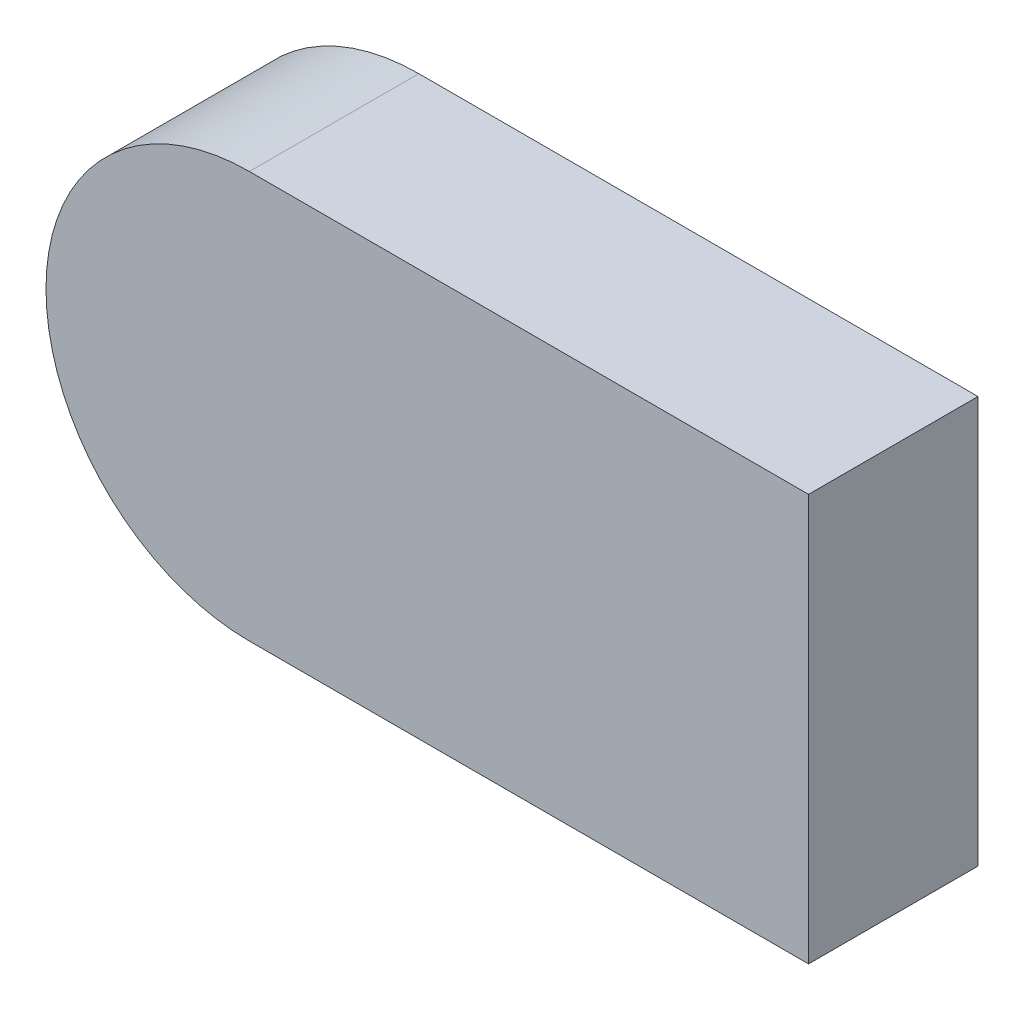
ISO-10303-21;
HEADER;
FILE_DESCRIPTION(('STEP AP214'),'2;1');
FILE_NAME('part.step','',(''),(''),'','','');
FILE_SCHEMA(('AUTOMOTIVE_DESIGN { 1 0 10303 214 1 1 1 1 }'));
ENDSEC;
DATA;
#1=APPLICATION_CONTEXT('core data for automotive mechanical design processes');
#2=APPLICATION_PROTOCOL_DEFINITION('international standard','automotive_design',2000,#1);
#3=PRODUCT_CONTEXT('',#1,'mechanical');
#4=PRODUCT('Part','Part','',(#3));
#5=PRODUCT_RELATED_PRODUCT_CATEGORY('part','',(#4));
#6=PRODUCT_DEFINITION_FORMATION('','',#4);
#7=PRODUCT_DEFINITION_CONTEXT('part definition',#1,'design');
#8=PRODUCT_DEFINITION('design','',#6,#7);
#9=PRODUCT_DEFINITION_SHAPE('','',#8);
#10=(LENGTH_UNIT() NAMED_UNIT(*) SI_UNIT(.MILLI.,.METRE.));
#11=(NAMED_UNIT(*) PLANE_ANGLE_UNIT() SI_UNIT($,.RADIAN.));
#12=(NAMED_UNIT(*) SI_UNIT($,.STERADIAN.) SOLID_ANGLE_UNIT());
#13=UNCERTAINTY_MEASURE_WITH_UNIT(LENGTH_MEASURE(1.E-05),#10,'distance_accuracy_value','');
#14=(GEOMETRIC_REPRESENTATION_CONTEXT(3) GLOBAL_UNCERTAINTY_ASSIGNED_CONTEXT((#13)) GLOBAL_UNIT_ASSIGNED_CONTEXT((#10,
#11,#12)) REPRESENTATION_CONTEXT('',''));
#15=CARTESIAN_POINT('',(0.,0.,0.));
#16=DIRECTION('',(0.,0.,1.));
#17=DIRECTION('',(1.,0.,0.));
#18=AXIS2_PLACEMENT_3D('',#15,#16,#17);
#19=CARTESIAN_POINT('',(4.05,-0.87,0.));
#20=DIRECTION('',(0.,-1.,0.));
#21=DIRECTION('',(-1.,0.,0.));
#22=AXIS2_PLACEMENT_3D('',#19,#20,#21);
#23=PLANE('',#22);
#24=DIRECTION('',(0.,0.,1.));
#25=VECTOR('',#24,1.);
#26=CARTESIAN_POINT('',(4.05,-0.87,0.));
#27=LINE('',#26,#25);
#28=CARTESIAN_POINT('',(4.05,-0.87,0.));
#29=VERTEX_POINT('',#28);
#30=CARTESIAN_POINT('',(4.05,-0.87,0.1));
#31=VERTEX_POINT('',#30);
#32=EDGE_CURVE('E11',#29,#31,#27,.T.);
#33=ORIENTED_EDGE('',*,*,#32,.T.);
#34=DIRECTION('',(-1.,0.,0.));
#35=VECTOR('',#34,1.);
#36=CARTESIAN_POINT('',(4.05,-0.87,0.1));
#37=LINE('',#36,#35);
#38=CARTESIAN_POINT('',(3.72,-0.87,0.1));
#39=VERTEX_POINT('',#38);
#40=EDGE_CURVE('E24',#31,#39,#37,.T.);
#41=ORIENTED_EDGE('',*,*,#40,.T.);
#42=DIRECTION('',(0.,0.,1.));
#43=VECTOR('',#42,1.);
#44=CARTESIAN_POINT('',(3.72,-0.87,0.));
#45=LINE('',#44,#43);
#46=CARTESIAN_POINT('',(3.72,-0.87,0.));
#47=VERTEX_POINT('',#46);
#48=EDGE_CURVE('E86',#47,#39,#45,.T.);
#49=ORIENTED_EDGE('',*,*,#48,.F.);
#50=DIRECTION('',(-1.,0.,0.));
#51=VECTOR('',#50,1.);
#52=CARTESIAN_POINT('',(4.05,-0.87,0.));
#53=LINE('',#52,#51);
#54=EDGE_CURVE('E83',#29,#47,#53,.T.);
#55=ORIENTED_EDGE('',*,*,#54,.F.);
#56=EDGE_LOOP('',(#33,#41,#49,#55));
#57=FACE_BOUND('',#56,.T.);
#58=ADVANCED_FACE('F17',(#57),#23,.T.);
#59=CARTESIAN_POINT('',(3.72,-0.75,0.));
#60=DIRECTION('',(0.,0.,-1.));
#61=DIRECTION('',(1.,0.,0.));
#62=AXIS2_PLACEMENT_3D('',#59,#60,#61);
#63=CYLINDRICAL_SURFACE('',#62,0.12);
#64=CARTESIAN_POINT('',(3.72,-0.75,0.));
#65=DIRECTION('',(0.,0.,1.));
#66=DIRECTION('',(1.,0.,0.));
#67=AXIS2_PLACEMENT_3D('',#64,#65,#66);
#68=CIRCLE('',#67,0.12);
#69=CARTESIAN_POINT('',(3.72,-0.63,0.));
#70=VERTEX_POINT('',#69);
#71=EDGE_CURVE('E80',#70,#47,#68,.T.);
#72=ORIENTED_EDGE('',*,*,#71,.T.);
#73=ORIENTED_EDGE('',*,*,#48,.T.);
#74=CARTESIAN_POINT('',(3.72,-0.75,0.1));
#75=DIRECTION('',(0.,0.,1.));
#76=DIRECTION('',(1.,0.,0.));
#77=AXIS2_PLACEMENT_3D('',#74,#75,#76);
#78=CIRCLE('',#77,0.12);
#79=CARTESIAN_POINT('',(3.72,-0.63,0.1));
#80=VERTEX_POINT('',#79);
#81=EDGE_CURVE('E78',#80,#39,#78,.T.);
#82=ORIENTED_EDGE('',*,*,#81,.F.);
#83=DIRECTION('',(0.,0.,1.));
#84=VECTOR('',#83,1.);
#85=CARTESIAN_POINT('',(3.72,-0.63,0.));
#86=LINE('',#85,#84);
#87=EDGE_CURVE('E67',#70,#80,#86,.T.);
#88=ORIENTED_EDGE('',*,*,#87,.F.);
#89=EDGE_LOOP('',(#72,#73,#82,#88));
#90=FACE_BOUND('',#89,.T.);
#91=ADVANCED_FACE('F89',(#90),#63,.T.);
#92=CARTESIAN_POINT('',(4.05,-0.63,0.));
#93=DIRECTION('',(0.,-1.,0.));
#94=DIRECTION('',(-1.,0.,0.));
#95=AXIS2_PLACEMENT_3D('',#92,#93,#94);
#96=PLANE('',#95);
#97=DIRECTION('',(-1.,0.,0.));
#98=VECTOR('',#97,1.);
#99=CARTESIAN_POINT('',(4.05,-0.63,0.));
#100=LINE('',#99,#98);
#101=CARTESIAN_POINT('',(4.05,-0.63,0.));
#102=VERTEX_POINT('',#101);
#103=EDGE_CURVE('E70',#102,#70,#100,.T.);
#104=ORIENTED_EDGE('',*,*,#103,.T.);
#105=ORIENTED_EDGE('',*,*,#87,.T.);
#106=DIRECTION('',(-1.,0.,0.));
#107=VECTOR('',#106,1.);
#108=CARTESIAN_POINT('',(4.05,-0.63,0.1));
#109=LINE('',#108,#107);
#110=CARTESIAN_POINT('',(4.05,-0.63,0.1));
#111=VERTEX_POINT('',#110);
#112=EDGE_CURVE('E61',#111,#80,#109,.T.);
#113=ORIENTED_EDGE('',*,*,#112,.F.);
#114=DIRECTION('',(0.,0.,1.));
#115=VECTOR('',#114,1.);
#116=CARTESIAN_POINT('',(4.05,-0.63,0.));
#117=LINE('',#116,#115);
#118=EDGE_CURVE('E51',#102,#111,#117,.T.);
#119=ORIENTED_EDGE('',*,*,#118,.F.);
#120=EDGE_LOOP('',(#104,#105,#113,#119));
#121=FACE_BOUND('',#120,.T.);
#122=ADVANCED_FACE('F65',(#121),#96,.F.);
#123=CARTESIAN_POINT('',(4.05,-0.87,0.));
#124=DIRECTION('',(-1.,0.,0.));
#125=DIRECTION('',(0.,1.,0.));
#126=AXIS2_PLACEMENT_3D('',#123,#124,#125);
#127=PLANE('',#126);
#128=DIRECTION('',(0.,1.,0.));
#129=VECTOR('',#128,1.);
#130=CARTESIAN_POINT('',(4.05,-0.87,0.));
#131=LINE('',#130,#129);
#132=EDGE_CURVE('E57',#29,#102,#131,.T.);
#133=ORIENTED_EDGE('',*,*,#132,.T.);
#134=ORIENTED_EDGE('',*,*,#118,.T.);
#135=DIRECTION('',(0.,1.,0.));
#136=VECTOR('',#135,1.);
#137=CARTESIAN_POINT('',(4.05,-0.87,0.1));
#138=LINE('',#137,#136);
#139=EDGE_CURVE('E55',#31,#111,#138,.T.);
#140=ORIENTED_EDGE('',*,*,#139,.F.);
#141=ORIENTED_EDGE('',*,*,#32,.F.);
#142=EDGE_LOOP('',(#133,#134,#140,#141));
#143=FACE_BOUND('',#142,.T.);
#144=ADVANCED_FACE('F53',(#143),#127,.F.);
#145=CARTESIAN_POINT('',(3.849490847913,-0.75,0.));
#146=DIRECTION('',(0.,0.,-1.));
#147=DIRECTION('',(-1.,0.,0.));
#148=AXIS2_PLACEMENT_3D('',#145,#146,#147);
#149=PLANE('',#148);
#150=ORIENTED_EDGE('',*,*,#54,.T.);
#151=ORIENTED_EDGE('',*,*,#71,.F.);
#152=ORIENTED_EDGE('',*,*,#103,.F.);
#153=ORIENTED_EDGE('',*,*,#132,.F.);
#154=EDGE_LOOP('',(#150,#151,#152,#153));
#155=FACE_BOUND('',#154,.T.);
#156=ADVANCED_FACE('F91',(#155),#149,.T.);
#157=CARTESIAN_POINT('',(3.849490847913,-0.75,0.1));
#158=DIRECTION('',(0.,0.,-1.));
#159=DIRECTION('',(-1.,0.,0.));
#160=AXIS2_PLACEMENT_3D('',#157,#158,#159);
#161=PLANE('',#160);
#162=ORIENTED_EDGE('',*,*,#139,.T.);
#163=ORIENTED_EDGE('',*,*,#112,.T.);
#164=ORIENTED_EDGE('',*,*,#81,.T.);
#165=ORIENTED_EDGE('',*,*,#40,.F.);
#166=EDGE_LOOP('',(#162,#163,#164,#165));
#167=FACE_BOUND('',#166,.T.);
#168=ADVANCED_FACE('F72',(#167),#161,.F.);
#169=CLOSED_SHELL('',(#58,#91,#122,#144,#156,#168));
#170=MANIFOLD_SOLID_BREP('B1',#169);
#171=ADVANCED_BREP_SHAPE_REPRESENTATION('',(#18,#170),#14);
#172=SHAPE_DEFINITION_REPRESENTATION(#9,#171);
ENDSEC;
END-ISO-10303-21;
